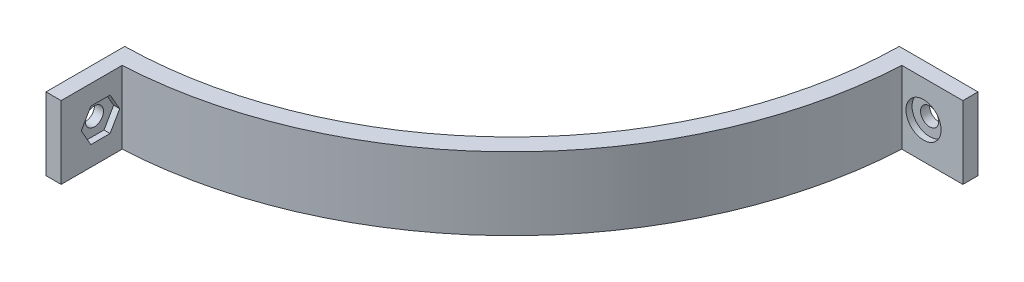
ISO-10303-21;
HEADER;
FILE_DESCRIPTION(('STEP AP214'),'2;1');
FILE_NAME('part.step','',(''),(''),'','','');
FILE_SCHEMA(('AUTOMOTIVE_DESIGN { 1 0 10303 214 1 1 1 1 }'));
ENDSEC;
DATA;
#1=APPLICATION_CONTEXT('core data for automotive mechanical design processes');
#2=APPLICATION_PROTOCOL_DEFINITION('international standard','automotive_design',2000,#1);
#3=PRODUCT_CONTEXT('',#1,'mechanical');
#4=PRODUCT('Part','Part','',(#3));
#5=PRODUCT_RELATED_PRODUCT_CATEGORY('part','',(#4));
#6=PRODUCT_DEFINITION_FORMATION('','',#4);
#7=PRODUCT_DEFINITION_CONTEXT('part definition',#1,'design');
#8=PRODUCT_DEFINITION('design','',#6,#7);
#9=PRODUCT_DEFINITION_SHAPE('','',#8);
#10=(LENGTH_UNIT() NAMED_UNIT(*) SI_UNIT(.MILLI.,.METRE.));
#11=(NAMED_UNIT(*) PLANE_ANGLE_UNIT() SI_UNIT($,.RADIAN.));
#12=(NAMED_UNIT(*) SI_UNIT($,.STERADIAN.) SOLID_ANGLE_UNIT());
#13=UNCERTAINTY_MEASURE_WITH_UNIT(LENGTH_MEASURE(1.E-05),#10,'distance_accuracy_value','');
#14=(GEOMETRIC_REPRESENTATION_CONTEXT(3) GLOBAL_UNCERTAINTY_ASSIGNED_CONTEXT((#13)) GLOBAL_UNIT_ASSIGNED_CONTEXT((#10,
#11,#12)) REPRESENTATION_CONTEXT('',''));
#15=CARTESIAN_POINT('',(0.,0.,0.));
#16=DIRECTION('',(0.,0.,1.));
#17=DIRECTION('',(1.,0.,0.));
#18=AXIS2_PLACEMENT_3D('',#15,#16,#17);
#19=CARTESIAN_POINT('',(0.,25.,0.));
#20=DIRECTION('',(0.,1.,0.));
#21=DIRECTION('',(0.,0.,1.));
#22=AXIS2_PLACEMENT_3D('',#19,#20,#21);
#23=PLANE('',#22);
#24=CARTESIAN_POINT('',(0.,25.,0.));
#25=DIRECTION('',(0.,1.,0.));
#26=DIRECTION('',(0.,0.,1.));
#27=AXIS2_PLACEMENT_3D('',#24,#25,#26);
#28=CIRCLE('',#27,65.);
#29=CARTESIAN_POINT('',(1.00000000000071,25.,64.9923072370877));
#30=VERTEX_POINT('',#29);
#31=CARTESIAN_POINT('',(64.9923072370877,25.,1.));
#32=VERTEX_POINT('',#31);
#33=EDGE_CURVE('E158',#30,#32,#28,.T.);
#34=ORIENTED_EDGE('',*,*,#33,.F.);
#35=DIRECTION('',(0.,0.,1.));
#36=VECTOR('',#35,1.);
#37=CARTESIAN_POINT('',(1.00000000000071,25.,68.));
#38=LINE('',#37,#36);
#39=CARTESIAN_POINT('',(1.00000000000082,25.,78.));
#40=VERTEX_POINT('',#39);
#41=EDGE_CURVE('E141',#30,#40,#38,.T.);
#42=ORIENTED_EDGE('',*,*,#41,.T.);
#43=DIRECTION('',(-1.,0.,0.));
#44=VECTOR('',#43,1.);
#45=CARTESIAN_POINT('',(-3.49999999999918,25.,78.));
#46=LINE('',#45,#44);
#47=CARTESIAN_POINT('',(3.50000000000082,25.,78.));
#48=VERTEX_POINT('',#47);
#49=EDGE_CURVE('E177',#48,#40,#46,.T.);
#50=ORIENTED_EDGE('',*,*,#49,.F.);
#51=DIRECTION('',(0.,0.,-1.));
#52=VECTOR('',#51,1.);
#53=CARTESIAN_POINT('',(3.50000000000082,25.,78.));
#54=LINE('',#53,#52);
#55=CARTESIAN_POINT('',(3.50000000000071,25.,67.9098667352543));
#56=VERTEX_POINT('',#55);
#57=EDGE_CURVE('E11',#48,#56,#54,.T.);
#58=ORIENTED_EDGE('',*,*,#57,.T.);
#59=CARTESIAN_POINT('',(0.,25.,0.));
#60=DIRECTION('',(0.,1.,0.));
#61=DIRECTION('',(0.,0.,1.));
#62=AXIS2_PLACEMENT_3D('',#59,#60,#61);
#63=CIRCLE('',#62,68.);
#64=CARTESIAN_POINT('',(67.9098667352543,25.,3.5));
#65=VERTEX_POINT('',#64);
#66=EDGE_CURVE('E166',#56,#65,#63,.T.);
#67=ORIENTED_EDGE('',*,*,#66,.T.);
#68=DIRECTION('',(-1.,0.,0.));
#69=VECTOR('',#68,1.);
#70=CARTESIAN_POINT('',(78.,25.,3.5));
#71=LINE('',#70,#69);
#72=CARTESIAN_POINT('',(78.,25.,3.5));
#73=VERTEX_POINT('',#72);
#74=EDGE_CURVE('E167',#73,#65,#71,.T.);
#75=ORIENTED_EDGE('',*,*,#74,.F.);
#76=DIRECTION('',(0.,0.,1.));
#77=VECTOR('',#76,1.);
#78=CARTESIAN_POINT('',(78.,25.,3.5));
#79=LINE('',#78,#77);
#80=CARTESIAN_POINT('',(78.,25.,1.));
#81=VERTEX_POINT('',#80);
#82=EDGE_CURVE('E196',#81,#73,#79,.T.);
#83=ORIENTED_EDGE('',*,*,#82,.F.);
#84=DIRECTION('',(1.,0.,0.));
#85=VECTOR('',#84,1.);
#86=CARTESIAN_POINT('',(68.,25.,1.));
#87=LINE('',#86,#85);
#88=EDGE_CURVE('E164',#32,#81,#87,.T.);
#89=ORIENTED_EDGE('',*,*,#88,.F.);
#90=EDGE_LOOP('',(#34,#42,#50,#58,#67,#75,#83,#89));
#91=FACE_BOUND('',#90,.T.);
#92=ADVANCED_FACE('F37',(#91),#23,.T.);
#93=CARTESIAN_POINT('',(0.,25.,0.));
#94=DIRECTION('',(0.,-1.,0.));
#95=DIRECTION('',(0.,0.,-1.));
#96=AXIS2_PLACEMENT_3D('',#93,#94,#95);
#97=CYLINDRICAL_SURFACE('',#96,65.);
#98=DIRECTION('',(0.,-1.,0.));
#99=VECTOR('',#98,1.);
#100=CARTESIAN_POINT('',(1.00000000000071,25.,64.9923072370877));
#101=LINE('',#100,#99);
#102=CARTESIAN_POINT('',(1.00000000000071,13.,64.9923072370877));
#103=VERTEX_POINT('',#102);
#104=EDGE_CURVE('E145',#30,#103,#101,.T.);
#105=ORIENTED_EDGE('',*,*,#104,.F.);
#106=ORIENTED_EDGE('',*,*,#33,.T.);
#107=DIRECTION('',(0.,-1.,0.));
#108=VECTOR('',#107,1.);
#109=CARTESIAN_POINT('',(64.9923072370877,25.,1.));
#110=LINE('',#109,#108);
#111=CARTESIAN_POINT('',(64.9923072370877,13.,1.));
#112=VERTEX_POINT('',#111);
#113=EDGE_CURVE('E161',#112,#32,#110,.F.);
#114=ORIENTED_EDGE('',*,*,#113,.F.);
#115=CARTESIAN_POINT('',(0.,13.,0.));
#116=DIRECTION('',(0.,1.,0.));
#117=DIRECTION('',(0.,0.,1.));
#118=AXIS2_PLACEMENT_3D('',#115,#116,#117);
#119=CIRCLE('',#118,65.);
#120=EDGE_CURVE('E160',#103,#112,#119,.T.);
#121=ORIENTED_EDGE('',*,*,#120,.F.);
#122=EDGE_LOOP('',(#105,#106,#114,#121));
#123=FACE_BOUND('',#122,.T.);
#124=ADVANCED_FACE('F156',(#123),#97,.F.);
#125=CARTESIAN_POINT('',(0.,13.,0.));
#126=DIRECTION('',(0.,1.,0.));
#127=DIRECTION('',(0.,0.,1.));
#128=AXIS2_PLACEMENT_3D('',#125,#126,#127);
#129=PLANE('',#128);
#130=DIRECTION('',(0.,0.,1.));
#131=VECTOR('',#130,1.);
#132=CARTESIAN_POINT('',(1.00000000000071,13.,68.));
#133=LINE('',#132,#131);
#134=CARTESIAN_POINT('',(1.00000000000082,13.,78.));
#135=VERTEX_POINT('',#134);
#136=EDGE_CURVE('E270',#103,#135,#133,.T.);
#137=ORIENTED_EDGE('',*,*,#136,.F.);
#138=ORIENTED_EDGE('',*,*,#120,.T.);
#139=DIRECTION('',(-1.,0.,0.));
#140=VECTOR('',#139,1.);
#141=CARTESIAN_POINT('',(68.,13.,1.));
#142=LINE('',#141,#140);
#143=CARTESIAN_POINT('',(78.,13.,1.));
#144=VERTEX_POINT('',#143);
#145=EDGE_CURVE('E277',#144,#112,#142,.T.);
#146=ORIENTED_EDGE('',*,*,#145,.F.);
#147=DIRECTION('',(0.,0.,1.));
#148=VECTOR('',#147,1.);
#149=CARTESIAN_POINT('',(78.,13.,0.));
#150=LINE('',#149,#148);
#151=CARTESIAN_POINT('',(78.,13.,3.5));
#152=VERTEX_POINT('',#151);
#153=EDGE_CURVE('E275',#144,#152,#150,.T.);
#154=ORIENTED_EDGE('',*,*,#153,.T.);
#155=DIRECTION('',(1.,0.,0.));
#156=VECTOR('',#155,1.);
#157=CARTESIAN_POINT('',(78.,13.,3.5));
#158=LINE('',#157,#156);
#159=CARTESIAN_POINT('',(67.9098667352543,13.,3.5));
#160=VERTEX_POINT('',#159);
#161=EDGE_CURVE('E201',#160,#152,#158,.T.);
#162=ORIENTED_EDGE('',*,*,#161,.F.);
#163=CARTESIAN_POINT('',(0.,13.,0.));
#164=DIRECTION('',(0.,1.,0.));
#165=DIRECTION('',(0.,0.,1.));
#166=AXIS2_PLACEMENT_3D('',#163,#164,#165);
#167=CIRCLE('',#166,68.);
#168=CARTESIAN_POINT('',(3.50000000000071,13.,67.9098667352543));
#169=VERTEX_POINT('',#168);
#170=EDGE_CURVE('E186',#169,#160,#167,.T.);
#171=ORIENTED_EDGE('',*,*,#170,.F.);
#172=DIRECTION('',(0.,0.,-1.));
#173=VECTOR('',#172,1.);
#174=CARTESIAN_POINT('',(3.50000000000082,13.,78.));
#175=LINE('',#174,#173);
#176=CARTESIAN_POINT('',(3.50000000000082,13.,78.));
#177=VERTEX_POINT('',#176);
#178=EDGE_CURVE('E183',#177,#169,#175,.T.);
#179=ORIENTED_EDGE('',*,*,#178,.F.);
#180=DIRECTION('',(-1.,0.,0.));
#181=VECTOR('',#180,1.);
#182=CARTESIAN_POINT('',(8.17006633289293E-13,13.,78.));
#183=LINE('',#182,#181);
#184=EDGE_CURVE('E185',#177,#135,#183,.T.);
#185=ORIENTED_EDGE('',*,*,#184,.T.);
#186=EDGE_LOOP('',(#137,#138,#146,#154,#162,#171,#179,#185));
#187=FACE_BOUND('',#186,.T.);
#188=ADVANCED_FACE('F283',(#187),#129,.F.);
#189=CARTESIAN_POINT('',(3.50000000000082,25.,78.));
#190=DIRECTION('',(-1.,0.,0.));
#191=DIRECTION('',(0.,0.,1.));
#192=AXIS2_PLACEMENT_3D('',#189,#190,#191);
#193=PLANE('',#192);
#194=DIRECTION('',(0.,1.,0.));
#195=VECTOR('',#194,1.);
#196=CARTESIAN_POINT('',(3.50000000000082,25.,78.));
#197=LINE('',#196,#195);
#198=EDGE_CURVE('E153',#177,#48,#197,.T.);
#199=ORIENTED_EDGE('',*,*,#198,.F.);
#200=ORIENTED_EDGE('',*,*,#178,.T.);
#201=DIRECTION('',(0.,-1.,0.));
#202=VECTOR('',#201,1.);
#203=CARTESIAN_POINT('',(3.50000000000071,25.,67.9098667352543));
#204=LINE('',#203,#202);
#205=EDGE_CURVE('E45',#169,#56,#204,.F.);
#206=ORIENTED_EDGE('',*,*,#205,.T.);
#207=ORIENTED_EDGE('',*,*,#57,.F.);
#208=EDGE_LOOP('',(#199,#200,#206,#207));
#209=FACE_BOUND('',#208,.T.);
#210=DIRECTION('',(0.,0.866025403784438,-0.500000000000001));
#211=VECTOR('',#210,1.);
#212=CARTESIAN_POINT('',(3.50000000000073,16.25,69.9122867597285));
#213=LINE('',#212,#211);
#214=CARTESIAN_POINT('',(3.50000000000073,16.25,69.9122867597285));
#215=VERTEX_POINT('',#214);
#216=CARTESIAN_POINT('',(3.50000000000072,19.,68.324573519457));
#217=VERTEX_POINT('',#216);
#218=EDGE_CURVE('E264',#215,#217,#213,.T.);
#219=ORIENTED_EDGE('',*,*,#218,.F.);
#220=DIRECTION('',(0.,0.,-1.));
#221=VECTOR('',#220,1.);
#222=CARTESIAN_POINT('',(3.50000000000077,16.25,73.0877132402714));
#223=LINE('',#222,#221);
#224=CARTESIAN_POINT('',(3.50000000000077,16.25,73.0877132402714));
#225=VERTEX_POINT('',#224);
#226=EDGE_CURVE('E52',#225,#215,#223,.T.);
#227=ORIENTED_EDGE('',*,*,#226,.F.);
#228=DIRECTION('',(0.,-0.86602540378444,-0.499999999999997));
#229=VECTOR('',#228,1.);
#230=CARTESIAN_POINT('',(3.50000000000078,19.,74.6754264805429));
#231=LINE('',#230,#229);
#232=CARTESIAN_POINT('',(3.50000000000078,19.,74.6754264805429));
#233=VERTEX_POINT('',#232);
#234=EDGE_CURVE('E226',#233,#225,#231,.T.);
#235=ORIENTED_EDGE('',*,*,#234,.F.);
#236=DIRECTION('',(0.,-0.86602540378444,0.499999999999998));
#237=VECTOR('',#236,1.);
#238=CARTESIAN_POINT('',(3.50000000000077,21.75,73.0877132402714));
#239=LINE('',#238,#237);
#240=CARTESIAN_POINT('',(3.50000000000077,21.75,73.0877132402714));
#241=VERTEX_POINT('',#240);
#242=EDGE_CURVE('E231',#241,#233,#239,.T.);
#243=ORIENTED_EDGE('',*,*,#242,.F.);
#244=DIRECTION('',(0.,0.,1.));
#245=VECTOR('',#244,1.);
#246=CARTESIAN_POINT('',(3.50000000000073,21.75,69.9122867597285));
#247=LINE('',#246,#245);
#248=CARTESIAN_POINT('',(3.50000000000073,21.75,69.9122867597285));
#249=VERTEX_POINT('',#248);
#250=EDGE_CURVE('E236',#249,#241,#247,.T.);
#251=ORIENTED_EDGE('',*,*,#250,.F.);
#252=DIRECTION('',(0.,0.866025403784439,0.5));
#253=VECTOR('',#252,1.);
#254=CARTESIAN_POINT('',(3.50000000000072,19.,68.324573519457));
#255=LINE('',#254,#253);
#256=EDGE_CURVE('E241',#217,#249,#255,.T.);
#257=ORIENTED_EDGE('',*,*,#256,.F.);
#258=EDGE_LOOP('',(#219,#227,#235,#243,#251,#257));
#259=FACE_BOUND('',#258,.T.);
#260=ADVANCED_FACE('F39',(#209,#259),#193,.F.);
#261=CARTESIAN_POINT('',(0.,25.,0.));
#262=DIRECTION('',(0.,-1.,0.));
#263=DIRECTION('',(0.,0.,-1.));
#264=AXIS2_PLACEMENT_3D('',#261,#262,#263);
#265=CYLINDRICAL_SURFACE('',#264,68.);
#266=ORIENTED_EDGE('',*,*,#205,.F.);
#267=ORIENTED_EDGE('',*,*,#170,.T.);
#268=DIRECTION('',(0.,-1.,0.));
#269=VECTOR('',#268,1.);
#270=CARTESIAN_POINT('',(67.9098667352543,25.,3.5));
#271=LINE('',#270,#269);
#272=EDGE_CURVE('E193',#65,#160,#271,.T.);
#273=ORIENTED_EDGE('',*,*,#272,.F.);
#274=ORIENTED_EDGE('',*,*,#66,.F.);
#275=EDGE_LOOP('',(#266,#267,#273,#274));
#276=FACE_BOUND('',#275,.T.);
#277=ADVANCED_FACE('F190',(#276),#265,.T.);
#278=CARTESIAN_POINT('',(8.17006633289293E-13,0.,78.));
#279=DIRECTION('',(0.,0.,1.));
#280=DIRECTION('',(1.,0.,0.));
#281=AXIS2_PLACEMENT_3D('',#278,#279,#280);
#282=PLANE('',#281);
#283=ORIENTED_EDGE('',*,*,#184,.F.);
#284=ORIENTED_EDGE('',*,*,#198,.T.);
#285=ORIENTED_EDGE('',*,*,#49,.T.);
#286=DIRECTION('',(0.,1.,0.));
#287=VECTOR('',#286,1.);
#288=CARTESIAN_POINT('',(1.00000000000082,25.,78.));
#289=LINE('',#288,#287);
#290=EDGE_CURVE('E148',#135,#40,#289,.T.);
#291=ORIENTED_EDGE('',*,*,#290,.F.);
#292=EDGE_LOOP('',(#283,#284,#285,#291));
#293=FACE_BOUND('',#292,.T.);
#294=ADVANCED_FACE('F180',(#293),#282,.T.);
#295=CARTESIAN_POINT('',(1.00000000000071,25.,68.));
#296=DIRECTION('',(1.,0.,0.));
#297=DIRECTION('',(0.,0.,-1.));
#298=AXIS2_PLACEMENT_3D('',#295,#296,#297);
#299=PLANE('',#298);
#300=CARTESIAN_POINT('',(1.00000000000075,19.,71.5));
#301=DIRECTION('',(1.,0.,0.));
#302=DIRECTION('',(0.,0.,-1.));
#303=AXIS2_PLACEMENT_3D('',#300,#301,#302);
#304=CIRCLE('',#303,1.5);
#305=CARTESIAN_POINT('',(1.00000000000078,19.,73.));
#306=VERTEX_POINT('',#305);
#307=EDGE_CURVE('E266',#306,#306,#304,.T.);
#308=ORIENTED_EDGE('',*,*,#307,.T.);
#309=EDGE_LOOP('',(#308));
#310=FACE_BOUND('',#309,.T.);
#311=ORIENTED_EDGE('',*,*,#41,.F.);
#312=ORIENTED_EDGE('',*,*,#104,.T.);
#313=ORIENTED_EDGE('',*,*,#136,.T.);
#314=ORIENTED_EDGE('',*,*,#290,.T.);
#315=EDGE_LOOP('',(#311,#312,#313,#314));
#316=FACE_BOUND('',#315,.T.);
#317=ADVANCED_FACE('F143',(#310,#316),#299,.F.);
#318=CARTESIAN_POINT('',(78.,25.,3.5));
#319=DIRECTION('',(0.,0.,-1.));
#320=DIRECTION('',(-1.,0.,0.));
#321=AXIS2_PLACEMENT_3D('',#318,#319,#320);
#322=PLANE('',#321);
#323=CARTESIAN_POINT('',(71.5,19.,3.5));
#324=DIRECTION('',(0.,0.,1.));
#325=DIRECTION('',(1.,0.,0.));
#326=AXIS2_PLACEMENT_3D('',#323,#324,#325);
#327=CIRCLE('',#326,2.9);
#328=CARTESIAN_POINT('',(74.4,19.,3.5));
#329=VERTEX_POINT('',#328);
#330=EDGE_CURVE('E212',#329,#329,#327,.T.);
#331=ORIENTED_EDGE('',*,*,#330,.F.);
#332=EDGE_LOOP('',(#331));
#333=FACE_BOUND('',#332,.T.);
#334=ORIENTED_EDGE('',*,*,#272,.T.);
#335=ORIENTED_EDGE('',*,*,#161,.T.);
#336=DIRECTION('',(0.,-1.,0.));
#337=VECTOR('',#336,1.);
#338=CARTESIAN_POINT('',(78.,25.,3.5));
#339=LINE('',#338,#337);
#340=EDGE_CURVE('E171',#73,#152,#339,.T.);
#341=ORIENTED_EDGE('',*,*,#340,.F.);
#342=ORIENTED_EDGE('',*,*,#74,.T.);
#343=EDGE_LOOP('',(#334,#335,#341,#342));
#344=FACE_BOUND('',#343,.T.);
#345=ADVANCED_FACE('F200',(#333,#344),#322,.F.);
#346=CARTESIAN_POINT('',(78.,0.,0.));
#347=DIRECTION('',(1.,0.,0.));
#348=DIRECTION('',(0.,0.,-1.));
#349=AXIS2_PLACEMENT_3D('',#346,#347,#348);
#350=PLANE('',#349);
#351=ORIENTED_EDGE('',*,*,#153,.F.);
#352=DIRECTION('',(0.,-1.,0.));
#353=VECTOR('',#352,1.);
#354=CARTESIAN_POINT('',(78.,25.,1.));
#355=LINE('',#354,#353);
#356=EDGE_CURVE('E208',#81,#144,#355,.T.);
#357=ORIENTED_EDGE('',*,*,#356,.F.);
#358=ORIENTED_EDGE('',*,*,#82,.T.);
#359=ORIENTED_EDGE('',*,*,#340,.T.);
#360=EDGE_LOOP('',(#351,#357,#358,#359));
#361=FACE_BOUND('',#360,.T.);
#362=ADVANCED_FACE('F284',(#361),#350,.T.);
#363=CARTESIAN_POINT('',(68.,25.,1.));
#364=DIRECTION('',(0.,0.,1.));
#365=DIRECTION('',(1.,0.,0.));
#366=AXIS2_PLACEMENT_3D('',#363,#364,#365);
#367=PLANE('',#366);
#368=CARTESIAN_POINT('',(71.5,19.,1.));
#369=DIRECTION('',(0.,0.,1.));
#370=DIRECTION('',(1.,0.,0.));
#371=AXIS2_PLACEMENT_3D('',#368,#369,#370);
#372=CIRCLE('',#371,1.5);
#373=CARTESIAN_POINT('',(73.,19.,0.999999999999987));
#374=VERTEX_POINT('',#373);
#375=EDGE_CURVE('E215',#374,#374,#372,.T.);
#376=ORIENTED_EDGE('',*,*,#375,.T.);
#377=EDGE_LOOP('',(#376));
#378=FACE_BOUND('',#377,.T.);
#379=ORIENTED_EDGE('',*,*,#356,.T.);
#380=ORIENTED_EDGE('',*,*,#145,.T.);
#381=ORIENTED_EDGE('',*,*,#113,.T.);
#382=ORIENTED_EDGE('',*,*,#88,.T.);
#383=EDGE_LOOP('',(#379,#380,#381,#382));
#384=FACE_BOUND('',#383,.T.);
#385=ADVANCED_FACE('F281',(#378,#384),#367,.F.);
#386=CARTESIAN_POINT('',(71.5,19.,2.5));
#387=DIRECTION('',(0.,0.,1.));
#388=DIRECTION('',(1.,0.,0.));
#389=AXIS2_PLACEMENT_3D('',#386,#387,#388);
#390=CYLINDRICAL_SURFACE('',#389,2.9);
#391=CARTESIAN_POINT('',(71.5,19.,2.5));
#392=DIRECTION('',(0.,0.,1.));
#393=DIRECTION('',(1.,0.,0.));
#394=AXIS2_PLACEMENT_3D('',#391,#392,#393);
#395=CIRCLE('',#394,2.9);
#396=CARTESIAN_POINT('',(74.4,19.,2.5));
#397=VERTEX_POINT('',#396);
#398=EDGE_CURVE('E211',#397,#397,#395,.T.);
#399=ORIENTED_EDGE('',*,*,#398,.F.);
#400=EDGE_LOOP('',(#399));
#401=FACE_BOUND('',#400,.T.);
#402=ORIENTED_EDGE('',*,*,#330,.T.);
#403=EDGE_LOOP('',(#402));
#404=FACE_BOUND('',#403,.T.);
#405=ADVANCED_FACE('F291',(#401,#404),#390,.F.);
#406=CARTESIAN_POINT('',(71.5,19.,2.5));
#407=DIRECTION('',(0.,0.,1.));
#408=DIRECTION('',(1.,0.,0.));
#409=AXIS2_PLACEMENT_3D('',#406,#407,#408);
#410=PLANE('',#409);
#411=CARTESIAN_POINT('',(71.5,19.,2.5));
#412=DIRECTION('',(0.,0.,1.));
#413=DIRECTION('',(1.,0.,0.));
#414=AXIS2_PLACEMENT_3D('',#411,#412,#413);
#415=CIRCLE('',#414,1.5);
#416=CARTESIAN_POINT('',(73.,19.,2.49999999999999));
#417=VERTEX_POINT('',#416);
#418=EDGE_CURVE('E220',#417,#417,#415,.T.);
#419=ORIENTED_EDGE('',*,*,#418,.F.);
#420=EDGE_LOOP('',(#419));
#421=FACE_BOUND('',#420,.T.);
#422=ORIENTED_EDGE('',*,*,#398,.T.);
#423=EDGE_LOOP('',(#422));
#424=FACE_BOUND('',#423,.T.);
#425=ADVANCED_FACE('F388',(#421,#424),#410,.T.);
#426=CARTESIAN_POINT('',(71.5,19.,-78.));
#427=DIRECTION('',(0.,0.,1.));
#428=DIRECTION('',(1.,0.,0.));
#429=AXIS2_PLACEMENT_3D('',#426,#427,#428);
#430=CYLINDRICAL_SURFACE('',#429,1.5);
#431=CARTESIAN_POINT('',(73.,19.,2.49999999999999));
#432=CARTESIAN_POINT('',(73.,19.,2.48437499999999));
#433=CARTESIAN_POINT('',(73.,19.,2.46874999999999));
#434=CARTESIAN_POINT('',(73.,19.,2.43749999999999));
#435=CARTESIAN_POINT('',(73.,19.,2.42187499999999));
#436=CARTESIAN_POINT('',(73.,19.,2.39062499999998));
#437=CARTESIAN_POINT('',(73.,19.,2.37499999999998));
#438=CARTESIAN_POINT('',(73.,19.,2.34374999999998));
#439=CARTESIAN_POINT('',(73.,19.,2.32812499999998));
#440=CARTESIAN_POINT('',(73.,19.,2.29687499999999));
#441=CARTESIAN_POINT('',(73.,19.,2.28124999999999));
#442=CARTESIAN_POINT('',(73.,19.,2.24999999999999));
#443=CARTESIAN_POINT('',(73.,19.,2.23437499999999));
#444=CARTESIAN_POINT('',(73.,19.,2.20312499999999));
#445=CARTESIAN_POINT('',(73.,19.,2.18749999999999));
#446=CARTESIAN_POINT('',(73.,19.,2.15624999999999));
#447=CARTESIAN_POINT('',(73.,19.,2.14062499999999));
#448=CARTESIAN_POINT('',(73.,19.,2.10937499999999));
#449=CARTESIAN_POINT('',(73.,19.,2.09374999999999));
#450=CARTESIAN_POINT('',(73.,19.,2.06249999999999));
#451=CARTESIAN_POINT('',(73.,19.,2.04687499999998));
#452=CARTESIAN_POINT('',(73.,19.,2.01562499999998));
#453=CARTESIAN_POINT('',(73.,19.,1.99999999999998));
#454=CARTESIAN_POINT('',(73.,19.,1.96874999999999));
#455=CARTESIAN_POINT('',(73.,19.,1.95312499999999));
#456=CARTESIAN_POINT('',(73.,19.,1.92187499999999));
#457=CARTESIAN_POINT('',(73.,19.,1.90624999999999));
#458=CARTESIAN_POINT('',(73.,19.,1.87499999999999));
#459=CARTESIAN_POINT('',(73.,19.,1.85937499999999));
#460=CARTESIAN_POINT('',(73.,19.,1.82812499999999));
#461=CARTESIAN_POINT('',(73.,19.,1.81249999999999));
#462=CARTESIAN_POINT('',(73.,19.,1.78124999999999));
#463=CARTESIAN_POINT('',(73.,19.,1.76562499999999));
#464=CARTESIAN_POINT('',(73.,19.,1.73437499999999));
#465=CARTESIAN_POINT('',(73.,19.,1.71874999999999));
#466=CARTESIAN_POINT('',(73.,19.,1.68749999999999));
#467=CARTESIAN_POINT('',(73.,19.,1.67187499999998));
#468=CARTESIAN_POINT('',(73.,19.,1.64062499999998));
#469=CARTESIAN_POINT('',(73.,19.,1.62499999999998));
#470=CARTESIAN_POINT('',(73.,19.,1.59374999999998));
#471=CARTESIAN_POINT('',(73.,19.,1.57812499999998));
#472=CARTESIAN_POINT('',(73.,19.,1.54687499999998));
#473=CARTESIAN_POINT('',(73.,19.,1.53124999999999));
#474=CARTESIAN_POINT('',(73.,19.,1.49999999999999));
#475=CARTESIAN_POINT('',(73.,19.,1.48437499999999));
#476=CARTESIAN_POINT('',(73.,19.,1.45312499999999));
#477=CARTESIAN_POINT('',(73.,19.,1.43749999999999));
#478=CARTESIAN_POINT('',(73.,19.,1.40624999999999));
#479=CARTESIAN_POINT('',(73.,19.,1.39062499999999));
#480=CARTESIAN_POINT('',(73.,19.,1.35937499999999));
#481=CARTESIAN_POINT('',(73.,19.,1.34374999999999));
#482=CARTESIAN_POINT('',(73.,19.,1.31249999999998));
#483=CARTESIAN_POINT('',(73.,19.,1.29687499999998));
#484=CARTESIAN_POINT('',(73.,19.,1.26562499999998));
#485=CARTESIAN_POINT('',(73.,19.,1.24999999999998));
#486=CARTESIAN_POINT('',(73.,19.,1.21874999999999));
#487=CARTESIAN_POINT('',(73.,19.,1.20312499999999));
#488=CARTESIAN_POINT('',(73.,19.,1.17187499999999));
#489=CARTESIAN_POINT('',(73.,19.,1.15624999999999));
#490=CARTESIAN_POINT('',(73.,19.,1.12499999999999));
#491=CARTESIAN_POINT('',(73.,19.,1.10937499999999));
#492=CARTESIAN_POINT('',(73.,19.,1.07812499999999));
#493=CARTESIAN_POINT('',(73.,19.,1.06249999999999));
#494=CARTESIAN_POINT('',(73.,19.,1.03124999999999));
#495=CARTESIAN_POINT('',(73.,19.,1.01562499999999));
#496=CARTESIAN_POINT('',(73.,19.,0.999999999999987));
#497=B_SPLINE_CURVE_WITH_KNOTS('',3,(#431,#432,#433,#434,#435,#436,#437,#438,#439,#440,#441,
#442,#443,#444,#445,#446,#447,#448,#449,#450,#451,#452,#453,#454,#455,#456,#457,#458,#459,#460,
#461,#462,#463,#464,#465,#466,#467,#468,#469,#470,#471,#472,#473,#474,#475,#476,#477,#478,#479,
#480,#481,#482,#483,#484,#485,#486,#487,#488,#489,#490,#491,#492,#493,#494,#495,#496),
.UNSPECIFIED.,.F.,.F.,(4,2,2,2,2,2,2,2,2,2,2,2,2,2,2,2,2,2,2,2,2,2,2,2,2,2,2,2,2,2,2,2,4),(0.,
0.0468750000000018,0.0937500000000036,0.140625000000005,0.187500000000007,0.234374999999995,
0.281249999999997,0.328124999999999,0.375,0.421875000000002,0.468750000000004,0.515625000000006,
0.562499999999994,0.609374999999995,0.656249999999997,0.703124999999999,0.750000000000001,
0.796875000000002,0.843750000000004,0.890625000000006,0.937500000000008,0.984374999999996,
1.03125,1.078125,1.125,1.171875,1.21875,1.26562500000001,1.31249999999999,1.359375,1.40625,
1.453125,1.5),.UNSPECIFIED.);
#498=EDGE_CURVE('BSEAM396',#417,#374,#497,.T.);
#499=ORIENTED_EDGE('',*,*,#418,.T.);
#500=ORIENTED_EDGE('',*,*,#375,.F.);
#501=ORIENTED_EDGE('',*,*,#498,.T.);
#502=ORIENTED_EDGE('',*,*,#498,.F.);
#503=EDGE_LOOP('',(#499,#501,#500,#502));
#504=FACE_BOUND('',#503,.T.);
#505=ADVANCED_FACE('F396',(#504),#430,.F.);
#506=CARTESIAN_POINT('',(2.50000000000077,16.25,73.0877132402714));
#507=DIRECTION('',(0.,-1.,0.));
#508=DIRECTION('',(1.,0.,0.));
#509=AXIS2_PLACEMENT_3D('',#506,#507,#508);
#510=PLANE('',#509);
#511=ORIENTED_EDGE('',*,*,#226,.T.);
#512=DIRECTION('',(1.,0.,0.));
#513=VECTOR('',#512,1.);
#514=CARTESIAN_POINT('',(2.50000000000073,16.25,69.9122867597285));
#515=LINE('',#514,#513);
#516=CARTESIAN_POINT('',(2.50000000000073,16.25,69.9122867597285));
#517=VERTEX_POINT('',#516);
#518=EDGE_CURVE('E243',#517,#215,#515,.T.);
#519=ORIENTED_EDGE('',*,*,#518,.F.);
#520=DIRECTION('',(0.,0.,-1.));
#521=VECTOR('',#520,1.);
#522=CARTESIAN_POINT('',(2.50000000000077,16.25,73.0877132402714));
#523=LINE('',#522,#521);
#524=CARTESIAN_POINT('',(2.50000000000077,16.25,73.0877132402714));
#525=VERTEX_POINT('',#524);
#526=EDGE_CURVE('E259',#525,#517,#523,.T.);
#527=ORIENTED_EDGE('',*,*,#526,.F.);
#528=DIRECTION('',(1.,0.,0.));
#529=VECTOR('',#528,1.);
#530=CARTESIAN_POINT('',(2.50000000000077,16.25,73.0877132402714));
#531=LINE('',#530,#529);
#532=EDGE_CURVE('E224',#525,#225,#531,.T.);
#533=ORIENTED_EDGE('',*,*,#532,.T.);
#534=EDGE_LOOP('',(#511,#519,#527,#533));
#535=FACE_BOUND('',#534,.T.);
#536=ADVANCED_FACE('F404',(#535),#510,.F.);
#537=CARTESIAN_POINT('',(2.50000000000078,19.,74.6754264805429));
#538=DIRECTION('',(0.,-0.499999999999997,0.86602540378444));
#539=DIRECTION('',(0.,0.86602540378444,0.499999999999997));
#540=AXIS2_PLACEMENT_3D('',#537,#538,#539);
#541=PLANE('',#540);
#542=ORIENTED_EDGE('',*,*,#234,.T.);
#543=ORIENTED_EDGE('',*,*,#532,.F.);
#544=DIRECTION('',(0.,-0.86602540378444,-0.499999999999997));
#545=VECTOR('',#544,1.);
#546=CARTESIAN_POINT('',(2.50000000000078,19.,74.6754264805429));
#547=LINE('',#546,#545);
#548=CARTESIAN_POINT('',(2.50000000000078,19.,74.6754264805429));
#549=VERTEX_POINT('',#548);
#550=EDGE_CURVE('E248',#549,#525,#547,.T.);
#551=ORIENTED_EDGE('',*,*,#550,.F.);
#552=DIRECTION('',(1.,0.,0.));
#553=VECTOR('',#552,1.);
#554=CARTESIAN_POINT('',(2.50000000000078,19.,74.6754264805429));
#555=LINE('',#554,#553);
#556=EDGE_CURVE('E228',#549,#233,#555,.T.);
#557=ORIENTED_EDGE('',*,*,#556,.T.);
#558=EDGE_LOOP('',(#542,#543,#551,#557));
#559=FACE_BOUND('',#558,.T.);
#560=ADVANCED_FACE('F413',(#559),#541,.F.);
#561=CARTESIAN_POINT('',(2.50000000000077,21.75,73.0877132402714));
#562=DIRECTION('',(0.,0.499999999999998,0.86602540378444));
#563=DIRECTION('',(0.,0.86602540378444,-0.499999999999998));
#564=AXIS2_PLACEMENT_3D('',#561,#562,#563);
#565=PLANE('',#564);
#566=ORIENTED_EDGE('',*,*,#242,.T.);
#567=ORIENTED_EDGE('',*,*,#556,.F.);
#568=DIRECTION('',(0.,-0.86602540378444,0.499999999999998));
#569=VECTOR('',#568,1.);
#570=CARTESIAN_POINT('',(2.50000000000077,21.75,73.0877132402714));
#571=LINE('',#570,#569);
#572=CARTESIAN_POINT('',(2.50000000000077,21.75,73.0877132402714));
#573=VERTEX_POINT('',#572);
#574=EDGE_CURVE('E251',#573,#549,#571,.T.);
#575=ORIENTED_EDGE('',*,*,#574,.F.);
#576=DIRECTION('',(1.,0.,0.));
#577=VECTOR('',#576,1.);
#578=CARTESIAN_POINT('',(2.50000000000077,21.75,73.0877132402714));
#579=LINE('',#578,#577);
#580=EDGE_CURVE('E233',#573,#241,#579,.T.);
#581=ORIENTED_EDGE('',*,*,#580,.T.);
#582=EDGE_LOOP('',(#566,#567,#575,#581));
#583=FACE_BOUND('',#582,.T.);
#584=ADVANCED_FACE('F422',(#583),#565,.F.);
#585=CARTESIAN_POINT('',(2.50000000000073,21.75,69.9122867597285));
#586=DIRECTION('',(0.,1.,0.));
#587=DIRECTION('',(-1.,0.,0.));
#588=AXIS2_PLACEMENT_3D('',#585,#586,#587);
#589=PLANE('',#588);
#590=ORIENTED_EDGE('',*,*,#250,.T.);
#591=ORIENTED_EDGE('',*,*,#580,.F.);
#592=DIRECTION('',(0.,0.,1.));
#593=VECTOR('',#592,1.);
#594=CARTESIAN_POINT('',(2.50000000000073,21.75,69.9122867597285));
#595=LINE('',#594,#593);
#596=CARTESIAN_POINT('',(2.50000000000073,21.75,69.9122867597285));
#597=VERTEX_POINT('',#596);
#598=EDGE_CURVE('E253',#597,#573,#595,.T.);
#599=ORIENTED_EDGE('',*,*,#598,.F.);
#600=DIRECTION('',(1.,0.,0.));
#601=VECTOR('',#600,1.);
#602=CARTESIAN_POINT('',(2.50000000000073,21.75,69.9122867597285));
#603=LINE('',#602,#601);
#604=EDGE_CURVE('E238',#597,#249,#603,.T.);
#605=ORIENTED_EDGE('',*,*,#604,.T.);
#606=EDGE_LOOP('',(#590,#591,#599,#605));
#607=FACE_BOUND('',#606,.T.);
#608=ADVANCED_FACE('F432',(#607),#589,.F.);
#609=CARTESIAN_POINT('',(2.50000000000071,19.,68.324573519457));
#610=DIRECTION('',(0.,0.5,-0.866025403784439));
#611=DIRECTION('',(0.,-0.866025403784439,-0.5));
#612=AXIS2_PLACEMENT_3D('',#609,#610,#611);
#613=PLANE('',#612);
#614=ORIENTED_EDGE('',*,*,#256,.T.);
#615=ORIENTED_EDGE('',*,*,#604,.F.);
#616=DIRECTION('',(0.,0.866025403784439,0.5));
#617=VECTOR('',#616,1.);
#618=CARTESIAN_POINT('',(2.50000000000071,19.,68.324573519457));
#619=LINE('',#618,#617);
#620=CARTESIAN_POINT('',(2.50000000000071,19.,68.324573519457));
#621=VERTEX_POINT('',#620);
#622=EDGE_CURVE('E255',#621,#597,#619,.T.);
#623=ORIENTED_EDGE('',*,*,#622,.F.);
#624=DIRECTION('',(1.,0.,0.));
#625=VECTOR('',#624,1.);
#626=CARTESIAN_POINT('',(2.50000000000071,19.,68.324573519457));
#627=LINE('',#626,#625);
#628=EDGE_CURVE('E245',#621,#217,#627,.T.);
#629=ORIENTED_EDGE('',*,*,#628,.T.);
#630=EDGE_LOOP('',(#614,#615,#623,#629));
#631=FACE_BOUND('',#630,.T.);
#632=ADVANCED_FACE('F442',(#631),#613,.F.);
#633=CARTESIAN_POINT('',(2.50000000000073,16.25,69.9122867597285));
#634=DIRECTION('',(0.,-0.500000000000001,-0.866025403784438));
#635=DIRECTION('',(0.,-0.866025403784438,0.500000000000001));
#636=AXIS2_PLACEMENT_3D('',#633,#634,#635);
#637=PLANE('',#636);
#638=ORIENTED_EDGE('',*,*,#218,.T.);
#639=ORIENTED_EDGE('',*,*,#628,.F.);
#640=DIRECTION('',(0.,0.866025403784438,-0.500000000000001));
#641=VECTOR('',#640,1.);
#642=CARTESIAN_POINT('',(2.50000000000073,16.25,69.9122867597285));
#643=LINE('',#642,#641);
#644=EDGE_CURVE('E257',#517,#621,#643,.T.);
#645=ORIENTED_EDGE('',*,*,#644,.F.);
#646=ORIENTED_EDGE('',*,*,#518,.T.);
#647=EDGE_LOOP('',(#638,#639,#645,#646));
#648=FACE_BOUND('',#647,.T.);
#649=ADVANCED_FACE('F452',(#648),#637,.F.);
#650=CARTESIAN_POINT('',(2.5,0.,0.));
#651=DIRECTION('',(1.,0.,0.));
#652=DIRECTION('',(0.,0.,-1.));
#653=AXIS2_PLACEMENT_3D('',#650,#651,#652);
#654=PLANE('',#653);
#655=CARTESIAN_POINT('',(2.50000000000075,19.,71.5));
#656=DIRECTION('',(1.,0.,0.));
#657=DIRECTION('',(0.,0.,-1.));
#658=AXIS2_PLACEMENT_3D('',#655,#656,#657);
#659=CIRCLE('',#658,1.5);
#660=CARTESIAN_POINT('',(2.50000000000078,19.,73.));
#661=VERTEX_POINT('',#660);
#662=EDGE_CURVE('E261',#661,#661,#659,.T.);
#663=ORIENTED_EDGE('',*,*,#662,.F.);
#664=EDGE_LOOP('',(#663));
#665=FACE_BOUND('',#664,.T.);
#666=ORIENTED_EDGE('',*,*,#526,.T.);
#667=ORIENTED_EDGE('',*,*,#644,.T.);
#668=ORIENTED_EDGE('',*,*,#622,.T.);
#669=ORIENTED_EDGE('',*,*,#598,.T.);
#670=ORIENTED_EDGE('',*,*,#574,.T.);
#671=ORIENTED_EDGE('',*,*,#550,.T.);
#672=EDGE_LOOP('',(#666,#667,#668,#669,#670,#671));
#673=FACE_BOUND('',#672,.T.);
#674=ADVANCED_FACE('F461',(#665,#673),#654,.T.);
#675=CARTESIAN_POINT('',(78.0000000000008,19.,71.4999999999992));
#676=DIRECTION('',(-1.,0.,0.));
#677=DIRECTION('',(0.,0.,1.));
#678=AXIS2_PLACEMENT_3D('',#675,#676,#677);
#679=CYLINDRICAL_SURFACE('',#678,1.5);
#680=CARTESIAN_POINT('',(2.50000000000078,19.,73.));
#681=CARTESIAN_POINT('',(2.48437500000078,19.,73.));
#682=CARTESIAN_POINT('',(2.46875000000078,19.,73.));
#683=CARTESIAN_POINT('',(2.43750000000078,19.,73.));
#684=CARTESIAN_POINT('',(2.42187500000078,19.,73.));
#685=CARTESIAN_POINT('',(2.39062500000078,19.,73.));
#686=CARTESIAN_POINT('',(2.37500000000077,19.,73.));
#687=CARTESIAN_POINT('',(2.34375000000077,19.,73.));
#688=CARTESIAN_POINT('',(2.32812500000077,19.,73.));
#689=CARTESIAN_POINT('',(2.29687500000078,19.,73.));
#690=CARTESIAN_POINT('',(2.28125000000078,19.,73.));
#691=CARTESIAN_POINT('',(2.25000000000078,19.,73.));
#692=CARTESIAN_POINT('',(2.23437500000078,19.,73.));
#693=CARTESIAN_POINT('',(2.20312500000078,19.,73.));
#694=CARTESIAN_POINT('',(2.18750000000078,19.,73.));
#695=CARTESIAN_POINT('',(2.15625000000078,19.,73.));
#696=CARTESIAN_POINT('',(2.14062500000078,19.,73.));
#697=CARTESIAN_POINT('',(2.10937500000078,19.,73.));
#698=CARTESIAN_POINT('',(2.09375000000078,19.,73.));
#699=CARTESIAN_POINT('',(2.06250000000078,19.,73.));
#700=CARTESIAN_POINT('',(2.04687500000078,19.,73.));
#701=CARTESIAN_POINT('',(2.01562500000077,19.,73.));
#702=CARTESIAN_POINT('',(2.00000000000077,19.,73.));
#703=CARTESIAN_POINT('',(1.96875000000078,19.,73.));
#704=CARTESIAN_POINT('',(1.95312500000078,19.,73.));
#705=CARTESIAN_POINT('',(1.92187500000079,19.,73.));
#706=CARTESIAN_POINT('',(1.90625000000078,19.,73.));
#707=CARTESIAN_POINT('',(1.87500000000078,19.,73.));
#708=CARTESIAN_POINT('',(1.85937500000078,19.,73.));
#709=CARTESIAN_POINT('',(1.82812500000078,19.,73.));
#710=CARTESIAN_POINT('',(1.81250000000078,19.,73.));
#711=CARTESIAN_POINT('',(1.78125000000078,19.,73.));
#712=CARTESIAN_POINT('',(1.76562500000078,19.,73.));
#713=CARTESIAN_POINT('',(1.73437500000078,19.,73.));
#714=CARTESIAN_POINT('',(1.71875000000078,19.,73.));
#715=CARTESIAN_POINT('',(1.68750000000078,19.,73.));
#716=CARTESIAN_POINT('',(1.67187500000078,19.,73.));
#717=CARTESIAN_POINT('',(1.64062500000077,19.,73.));
#718=CARTESIAN_POINT('',(1.62500000000077,19.,73.));
#719=CARTESIAN_POINT('',(1.59375000000077,19.,73.));
#720=CARTESIAN_POINT('',(1.57812500000077,19.,73.));
#721=CARTESIAN_POINT('',(1.54687500000078,19.,73.));
#722=CARTESIAN_POINT('',(1.53125000000078,19.,73.));
#723=CARTESIAN_POINT('',(1.50000000000078,19.,73.));
#724=CARTESIAN_POINT('',(1.48437500000078,19.,73.));
#725=CARTESIAN_POINT('',(1.45312500000078,19.,73.));
#726=CARTESIAN_POINT('',(1.43750000000078,19.,73.));
#727=CARTESIAN_POINT('',(1.40625000000078,19.,73.));
#728=CARTESIAN_POINT('',(1.39062500000078,19.,73.));
#729=CARTESIAN_POINT('',(1.35937500000078,19.,73.));
#730=CARTESIAN_POINT('',(1.34375000000078,19.,73.));
#731=CARTESIAN_POINT('',(1.31250000000078,19.,73.));
#732=CARTESIAN_POINT('',(1.29687500000078,19.,73.));
#733=CARTESIAN_POINT('',(1.26562500000077,19.,73.));
#734=CARTESIAN_POINT('',(1.25000000000077,19.,73.));
#735=CARTESIAN_POINT('',(1.21875000000078,19.,73.));
#736=CARTESIAN_POINT('',(1.20312500000078,19.,73.));
#737=CARTESIAN_POINT('',(1.17187500000078,19.,73.));
#738=CARTESIAN_POINT('',(1.15625000000078,19.,73.));
#739=CARTESIAN_POINT('',(1.12500000000078,19.,73.));
#740=CARTESIAN_POINT('',(1.10937500000078,19.,73.));
#741=CARTESIAN_POINT('',(1.07812500000078,19.,73.));
#742=CARTESIAN_POINT('',(1.06250000000078,19.,73.));
#743=CARTESIAN_POINT('',(1.03125000000078,19.,73.));
#744=CARTESIAN_POINT('',(1.01562500000078,19.,73.));
#745=CARTESIAN_POINT('',(1.00000000000078,19.,73.));
#746=B_SPLINE_CURVE_WITH_KNOTS('',3,(#680,#681,#682,#683,#684,#685,#686,#687,#688,#689,#690,
#691,#692,#693,#694,#695,#696,#697,#698,#699,#700,#701,#702,#703,#704,#705,#706,#707,#708,#709,
#710,#711,#712,#713,#714,#715,#716,#717,#718,#719,#720,#721,#722,#723,#724,#725,#726,#727,#728,
#729,#730,#731,#732,#733,#734,#735,#736,#737,#738,#739,#740,#741,#742,#743,#744,#745),
.UNSPECIFIED.,.F.,.F.,(4,2,2,2,2,2,2,2,2,2,2,2,2,2,2,2,2,2,2,2,2,2,2,2,2,2,2,2,2,2,2,2,4),(0.,
0.0468750000000018,0.0937500000000036,0.140625000000005,0.187500000000007,0.234374999999995,
0.281249999999997,0.328124999999999,0.375,0.421875000000002,0.468750000000004,0.515625000000006,
0.562499999999994,0.609374999999995,0.656249999999997,0.703124999999999,0.750000000000001,
0.796875000000002,0.843750000000004,0.890625000000006,0.937500000000008,0.984374999999996,
1.03125,1.078125,1.125,1.171875,1.21875,1.26562500000001,1.31249999999999,1.359375,1.40625,
1.453125,1.5),.UNSPECIFIED.);
#747=EDGE_CURVE('BSEAM366',#661,#306,#746,.T.);
#748=ORIENTED_EDGE('',*,*,#662,.T.);
#749=ORIENTED_EDGE('',*,*,#307,.F.);
#750=ORIENTED_EDGE('',*,*,#747,.T.);
#751=ORIENTED_EDGE('',*,*,#747,.F.);
#752=EDGE_LOOP('',(#748,#750,#749,#751));
#753=FACE_BOUND('',#752,.T.);
#754=ADVANCED_FACE('F366',(#753),#679,.F.);
#755=CLOSED_SHELL('',(#92,#124,#188,#260,#277,#294,#317,#345,#362,#385,#405,#425,#505,#536,#560,
#584,#608,#632,#649,#674,#754));
#756=MANIFOLD_SOLID_BREP('B2',#755);
#757=ADVANCED_BREP_SHAPE_REPRESENTATION('',(#18,#756),#14);
#758=SHAPE_DEFINITION_REPRESENTATION(#9,#757);
ENDSEC;
END-ISO-10303-21;
